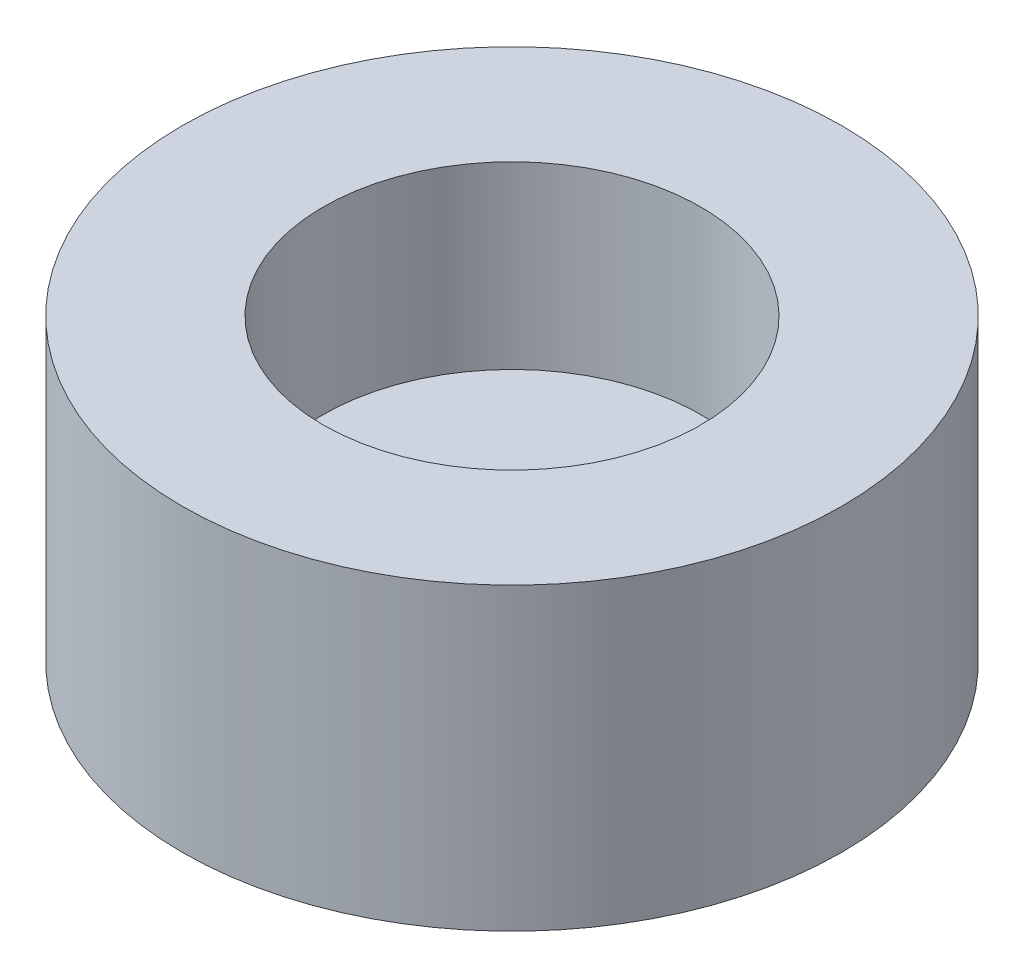
ISO-10303-21;
HEADER;
FILE_DESCRIPTION(('STEP AP214'),'2;1');
FILE_NAME('part.step','',(''),(''),'','','');
FILE_SCHEMA(('AUTOMOTIVE_DESIGN { 1 0 10303 214 1 1 1 1 }'));
ENDSEC;
DATA;
#1=APPLICATION_CONTEXT('core data for automotive mechanical design processes');
#2=APPLICATION_PROTOCOL_DEFINITION('international standard','automotive_design',2000,#1);
#3=PRODUCT_CONTEXT('',#1,'mechanical');
#4=PRODUCT('Part','Part','',(#3));
#5=PRODUCT_RELATED_PRODUCT_CATEGORY('part','',(#4));
#6=PRODUCT_DEFINITION_FORMATION('','',#4);
#7=PRODUCT_DEFINITION_CONTEXT('part definition',#1,'design');
#8=PRODUCT_DEFINITION('design','',#6,#7);
#9=PRODUCT_DEFINITION_SHAPE('','',#8);
#10=(LENGTH_UNIT() NAMED_UNIT(*) SI_UNIT(.MILLI.,.METRE.));
#11=(NAMED_UNIT(*) PLANE_ANGLE_UNIT() SI_UNIT($,.RADIAN.));
#12=(NAMED_UNIT(*) SI_UNIT($,.STERADIAN.) SOLID_ANGLE_UNIT());
#13=UNCERTAINTY_MEASURE_WITH_UNIT(LENGTH_MEASURE(1.E-05),#10,'distance_accuracy_value','');
#14=(GEOMETRIC_REPRESENTATION_CONTEXT(3) GLOBAL_UNCERTAINTY_ASSIGNED_CONTEXT((#13)) GLOBAL_UNIT_ASSIGNED_CONTEXT((#10,
#11,#12)) REPRESENTATION_CONTEXT('',''));
#15=CARTESIAN_POINT('',(0.,0.,0.));
#16=DIRECTION('',(0.,0.,1.));
#17=DIRECTION('',(1.,0.,0.));
#18=AXIS2_PLACEMENT_3D('',#15,#16,#17);
#19=CARTESIAN_POINT('',(0.,10.,0.));
#20=DIRECTION('',(0.,-1.,0.));
#21=DIRECTION('',(0.,0.,-1.));
#22=AXIS2_PLACEMENT_3D('',#19,#20,#21);
#23=CYLINDRICAL_SURFACE('',#22,11.);
#24=CARTESIAN_POINT('',(0.,10.,0.));
#25=DIRECTION('',(0.,1.,0.));
#26=DIRECTION('',(0.,0.,1.));
#27=AXIS2_PLACEMENT_3D('',#24,#25,#26);
#28=CIRCLE('',#27,11.);
#29=CARTESIAN_POINT('',(0.,10.,11.));
#30=VERTEX_POINT('',#29);
#31=EDGE_CURVE('E10',#30,#30,#28,.T.);
#32=ORIENTED_EDGE('',*,*,#31,.F.);
#33=EDGE_LOOP('',(#32));
#34=FACE_BOUND('',#33,.T.);
#35=CARTESIAN_POINT('',(0.,0.,0.));
#36=DIRECTION('',(0.,1.,0.));
#37=DIRECTION('',(0.,0.,1.));
#38=AXIS2_PLACEMENT_3D('',#35,#36,#37);
#39=CIRCLE('',#38,11.);
#40=CARTESIAN_POINT('',(0.,0.,11.));
#41=VERTEX_POINT('',#40);
#42=EDGE_CURVE('E34',#41,#41,#39,.T.);
#43=ORIENTED_EDGE('',*,*,#42,.T.);
#44=EDGE_LOOP('',(#43));
#45=FACE_BOUND('',#44,.T.);
#46=ADVANCED_FACE('F31',(#34,#45),#23,.T.);
#47=CARTESIAN_POINT('',(0.,10.,0.));
#48=DIRECTION('',(0.,1.,0.));
#49=DIRECTION('',(0.,0.,1.));
#50=AXIS2_PLACEMENT_3D('',#47,#48,#49);
#51=PLANE('',#50);
#52=CARTESIAN_POINT('',(0.,10.,0.));
#53=DIRECTION('',(0.,1.,0.));
#54=DIRECTION('',(0.,0.,1.));
#55=AXIS2_PLACEMENT_3D('',#52,#53,#54);
#56=CIRCLE('',#55,6.3);
#57=CARTESIAN_POINT('',(0.,10.,6.3));
#58=VERTEX_POINT('',#57);
#59=EDGE_CURVE('E43',#58,#58,#56,.T.);
#60=ORIENTED_EDGE('',*,*,#59,.F.);
#61=EDGE_LOOP('',(#60));
#62=FACE_BOUND('',#61,.T.);
#63=ORIENTED_EDGE('',*,*,#31,.T.);
#64=EDGE_LOOP('',(#63));
#65=FACE_BOUND('',#64,.T.);
#66=ADVANCED_FACE('F58',(#62,#65),#51,.T.);
#67=CARTESIAN_POINT('',(0.,0.,0.));
#68=DIRECTION('',(0.,1.,0.));
#69=DIRECTION('',(0.,0.,1.));
#70=AXIS2_PLACEMENT_3D('',#67,#68,#69);
#71=PLANE('',#70);
#72=ORIENTED_EDGE('',*,*,#42,.F.);
#73=EDGE_LOOP('',(#72));
#74=FACE_BOUND('',#73,.T.);
#75=ADVANCED_FACE('F54',(#74),#71,.F.);
#76=CARTESIAN_POINT('',(0.,4.,0.));
#77=DIRECTION('',(0.,1.,0.));
#78=DIRECTION('',(0.,0.,1.));
#79=AXIS2_PLACEMENT_3D('',#76,#77,#78);
#80=CYLINDRICAL_SURFACE('',#79,6.3);
#81=CARTESIAN_POINT('',(0.,4.,0.));
#82=DIRECTION('',(0.,1.,0.));
#83=DIRECTION('',(0.,0.,1.));
#84=AXIS2_PLACEMENT_3D('',#81,#82,#83);
#85=CIRCLE('',#84,6.3);
#86=CARTESIAN_POINT('',(0.,4.,6.3));
#87=VERTEX_POINT('',#86);
#88=EDGE_CURVE('E41',#87,#87,#85,.T.);
#89=ORIENTED_EDGE('',*,*,#88,.F.);
#90=EDGE_LOOP('',(#89));
#91=FACE_BOUND('',#90,.T.);
#92=ORIENTED_EDGE('',*,*,#59,.T.);
#93=EDGE_LOOP('',(#92));
#94=FACE_BOUND('',#93,.T.);
#95=ADVANCED_FACE('F51',(#91,#94),#80,.F.);
#96=CARTESIAN_POINT('',(0.,4.,0.));
#97=DIRECTION('',(0.,1.,0.));
#98=DIRECTION('',(0.,0.,1.));
#99=AXIS2_PLACEMENT_3D('',#96,#97,#98);
#100=PLANE('',#99);
#101=ORIENTED_EDGE('',*,*,#88,.T.);
#102=EDGE_LOOP('',(#101));
#103=FACE_BOUND('',#102,.T.);
#104=ADVANCED_FACE('F49',(#103),#100,.T.);
#105=CLOSED_SHELL('',(#46,#66,#75,#95,#104));
#106=MANIFOLD_SOLID_BREP('B2',#105);
#107=ADVANCED_BREP_SHAPE_REPRESENTATION('',(#18,#106),#14);
#108=SHAPE_DEFINITION_REPRESENTATION(#9,#107);
ENDSEC;
END-ISO-10303-21;
